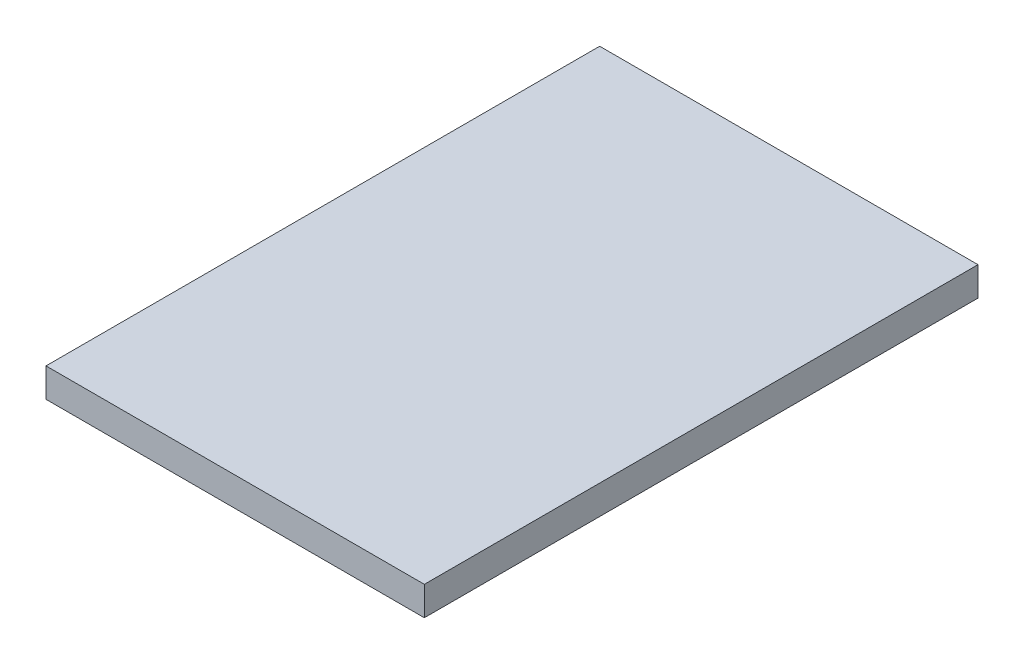
ISO-10303-21;
HEADER;
FILE_DESCRIPTION(('STEP AP214'),'2;1');
FILE_NAME('part.step','',(''),(''),'','','');
FILE_SCHEMA(('AUTOMOTIVE_DESIGN { 1 0 10303 214 1 1 1 1 }'));
ENDSEC;
DATA;
#1=APPLICATION_CONTEXT('core data for automotive mechanical design processes');
#2=APPLICATION_PROTOCOL_DEFINITION('international standard','automotive_design',2000,#1);
#3=PRODUCT_CONTEXT('',#1,'mechanical');
#4=PRODUCT('Part','Part','',(#3));
#5=PRODUCT_RELATED_PRODUCT_CATEGORY('part','',(#4));
#6=PRODUCT_DEFINITION_FORMATION('','',#4);
#7=PRODUCT_DEFINITION_CONTEXT('part definition',#1,'design');
#8=PRODUCT_DEFINITION('design','',#6,#7);
#9=PRODUCT_DEFINITION_SHAPE('','',#8);
#10=(LENGTH_UNIT() NAMED_UNIT(*) SI_UNIT(.MILLI.,.METRE.));
#11=(NAMED_UNIT(*) PLANE_ANGLE_UNIT() SI_UNIT($,.RADIAN.));
#12=(NAMED_UNIT(*) SI_UNIT($,.STERADIAN.) SOLID_ANGLE_UNIT());
#13=UNCERTAINTY_MEASURE_WITH_UNIT(LENGTH_MEASURE(1.E-05),#10,'distance_accuracy_value','');
#14=(GEOMETRIC_REPRESENTATION_CONTEXT(3) GLOBAL_UNCERTAINTY_ASSIGNED_CONTEXT((#13)) GLOBAL_UNIT_ASSIGNED_CONTEXT((#10,
#11,#12)) REPRESENTATION_CONTEXT('',''));
#15=CARTESIAN_POINT('',(0.,0.,0.));
#16=DIRECTION('',(0.,0.,1.));
#17=DIRECTION('',(1.,0.,0.));
#18=AXIS2_PLACEMENT_3D('',#15,#16,#17);
#19=CARTESIAN_POINT('',(0.,1.57,0.));
#20=DIRECTION('',(1.,0.,0.));
#21=DIRECTION('',(0.,0.,-1.));
#22=AXIS2_PLACEMENT_3D('',#19,#20,#21);
#23=PLANE('',#22);
#24=DIRECTION('',(0.,0.,1.));
#25=VECTOR('',#24,1.);
#26=CARTESIAN_POINT('',(0.,0.,0.));
#27=LINE('',#26,#25);
#28=CARTESIAN_POINT('',(0.,0.,-30.));
#29=VERTEX_POINT('',#28);
#30=CARTESIAN_POINT('',(0.,0.,0.));
#31=VERTEX_POINT('',#30);
#32=EDGE_CURVE('E106',#29,#31,#27,.T.);
#33=ORIENTED_EDGE('',*,*,#32,.T.);
#34=DIRECTION('',(0.,-1.,0.));
#35=VECTOR('',#34,1.);
#36=CARTESIAN_POINT('',(0.,1.57,0.));
#37=LINE('',#36,#35);
#38=CARTESIAN_POINT('',(0.,1.57,0.));
#39=VERTEX_POINT('',#38);
#40=EDGE_CURVE('E11',#39,#31,#37,.T.);
#41=ORIENTED_EDGE('',*,*,#40,.F.);
#42=DIRECTION('',(0.,0.,1.));
#43=VECTOR('',#42,1.);
#44=CARTESIAN_POINT('',(0.,1.57,0.));
#45=LINE('',#44,#43);
#46=CARTESIAN_POINT('',(0.,1.57,-30.));
#47=VERTEX_POINT('',#46);
#48=EDGE_CURVE('E94',#47,#39,#45,.T.);
#49=ORIENTED_EDGE('',*,*,#48,.F.);
#50=DIRECTION('',(0.,-1.,0.));
#51=VECTOR('',#50,1.);
#52=CARTESIAN_POINT('',(0.,1.57,-30.));
#53=LINE('',#52,#51);
#54=EDGE_CURVE('E102',#47,#29,#53,.T.);
#55=ORIENTED_EDGE('',*,*,#54,.T.);
#56=EDGE_LOOP('',(#33,#41,#49,#55));
#57=FACE_BOUND('',#56,.T.);
#58=ADVANCED_FACE('F43',(#57),#23,.F.);
#59=CARTESIAN_POINT('',(0.,1.57,0.));
#60=DIRECTION('',(0.,0.,-1.));
#61=DIRECTION('',(-1.,0.,0.));
#62=AXIS2_PLACEMENT_3D('',#59,#60,#61);
#63=PLANE('',#62);
#64=DIRECTION('',(1.,0.,0.));
#65=VECTOR('',#64,1.);
#66=CARTESIAN_POINT('',(0.,0.,0.));
#67=LINE('',#66,#65);
#68=CARTESIAN_POINT('',(20.5,0.,0.));
#69=VERTEX_POINT('',#68);
#70=EDGE_CURVE('E98',#31,#69,#67,.T.);
#71=ORIENTED_EDGE('',*,*,#70,.T.);
#72=DIRECTION('',(0.,-1.,0.));
#73=VECTOR('',#72,1.);
#74=CARTESIAN_POINT('',(20.5,1.57,0.));
#75=LINE('',#74,#73);
#76=CARTESIAN_POINT('',(20.5,1.57,0.));
#77=VERTEX_POINT('',#76);
#78=EDGE_CURVE('E51',#77,#69,#75,.T.);
#79=ORIENTED_EDGE('',*,*,#78,.F.);
#80=DIRECTION('',(1.,0.,0.));
#81=VECTOR('',#80,1.);
#82=CARTESIAN_POINT('',(0.,1.57,0.));
#83=LINE('',#82,#81);
#84=EDGE_CURVE('E89',#39,#77,#83,.T.);
#85=ORIENTED_EDGE('',*,*,#84,.F.);
#86=ORIENTED_EDGE('',*,*,#40,.T.);
#87=EDGE_LOOP('',(#71,#79,#85,#86));
#88=FACE_BOUND('',#87,.T.);
#89=ADVANCED_FACE('F97',(#88),#63,.F.);
#90=CARTESIAN_POINT('',(20.5,1.57,0.));
#91=DIRECTION('',(-1.,0.,0.));
#92=DIRECTION('',(0.,0.,1.));
#93=AXIS2_PLACEMENT_3D('',#90,#91,#92);
#94=PLANE('',#93);
#95=DIRECTION('',(0.,0.,-1.));
#96=VECTOR('',#95,1.);
#97=CARTESIAN_POINT('',(20.5,0.,0.));
#98=LINE('',#97,#96);
#99=CARTESIAN_POINT('',(20.5,0.,-30.));
#100=VERTEX_POINT('',#99);
#101=EDGE_CURVE('E76',#69,#100,#98,.T.);
#102=ORIENTED_EDGE('',*,*,#101,.T.);
#103=DIRECTION('',(0.,-1.,0.));
#104=VECTOR('',#103,1.);
#105=CARTESIAN_POINT('',(20.5,1.57,-30.));
#106=LINE('',#105,#104);
#107=CARTESIAN_POINT('',(20.5,1.57,-30.));
#108=VERTEX_POINT('',#107);
#109=EDGE_CURVE('E99',#108,#100,#106,.T.);
#110=ORIENTED_EDGE('',*,*,#109,.F.);
#111=DIRECTION('',(0.,0.,-1.));
#112=VECTOR('',#111,1.);
#113=CARTESIAN_POINT('',(20.5,1.57,0.));
#114=LINE('',#113,#112);
#115=EDGE_CURVE('E92',#77,#108,#114,.T.);
#116=ORIENTED_EDGE('',*,*,#115,.F.);
#117=ORIENTED_EDGE('',*,*,#78,.T.);
#118=EDGE_LOOP('',(#102,#110,#116,#117));
#119=FACE_BOUND('',#118,.T.);
#120=ADVANCED_FACE('F100',(#119),#94,.F.);
#121=CARTESIAN_POINT('',(0.,1.57,-30.));
#122=DIRECTION('',(0.,0.,1.));
#123=DIRECTION('',(1.,0.,0.));
#124=AXIS2_PLACEMENT_3D('',#121,#122,#123);
#125=PLANE('',#124);
#126=DIRECTION('',(-1.,0.,0.));
#127=VECTOR('',#126,1.);
#128=CARTESIAN_POINT('',(0.,0.,-30.));
#129=LINE('',#128,#127);
#130=EDGE_CURVE('E82',#100,#29,#129,.T.);
#131=ORIENTED_EDGE('',*,*,#130,.T.);
#132=ORIENTED_EDGE('',*,*,#54,.F.);
#133=DIRECTION('',(-1.,0.,0.));
#134=VECTOR('',#133,1.);
#135=CARTESIAN_POINT('',(0.,1.57,-30.));
#136=LINE('',#135,#134);
#137=EDGE_CURVE('E59',#108,#47,#136,.T.);
#138=ORIENTED_EDGE('',*,*,#137,.F.);
#139=ORIENTED_EDGE('',*,*,#109,.T.);
#140=EDGE_LOOP('',(#131,#132,#138,#139));
#141=FACE_BOUND('',#140,.T.);
#142=ADVANCED_FACE('F113',(#141),#125,.F.);
#143=CARTESIAN_POINT('',(0.,1.57,0.));
#144=DIRECTION('',(0.,-1.,0.));
#145=DIRECTION('',(0.,0.,-1.));
#146=AXIS2_PLACEMENT_3D('',#143,#144,#145);
#147=PLANE('',#146);
#148=ORIENTED_EDGE('',*,*,#48,.T.);
#149=ORIENTED_EDGE('',*,*,#84,.T.);
#150=ORIENTED_EDGE('',*,*,#115,.T.);
#151=ORIENTED_EDGE('',*,*,#137,.T.);
#152=EDGE_LOOP('',(#148,#149,#150,#151));
#153=FACE_BOUND('',#152,.T.);
#154=ADVANCED_FACE('F90',(#153),#147,.F.);
#155=CARTESIAN_POINT('',(0.,0.,0.));
#156=DIRECTION('',(0.,-1.,0.));
#157=DIRECTION('',(0.,0.,-1.));
#158=AXIS2_PLACEMENT_3D('',#155,#156,#157);
#159=PLANE('',#158);
#160=ORIENTED_EDGE('',*,*,#32,.F.);
#161=ORIENTED_EDGE('',*,*,#130,.F.);
#162=ORIENTED_EDGE('',*,*,#101,.F.);
#163=ORIENTED_EDGE('',*,*,#70,.F.);
#164=EDGE_LOOP('',(#160,#161,#162,#163));
#165=FACE_BOUND('',#164,.T.);
#166=ADVANCED_FACE('F116',(#165),#159,.T.);
#167=CLOSED_SHELL('',(#58,#89,#120,#142,#154,#166));
#168=MANIFOLD_SOLID_BREP('B2',#167);
#169=ADVANCED_BREP_SHAPE_REPRESENTATION('',(#18,#168),#14);
#170=SHAPE_DEFINITION_REPRESENTATION(#9,#169);
ENDSEC;
END-ISO-10303-21;
